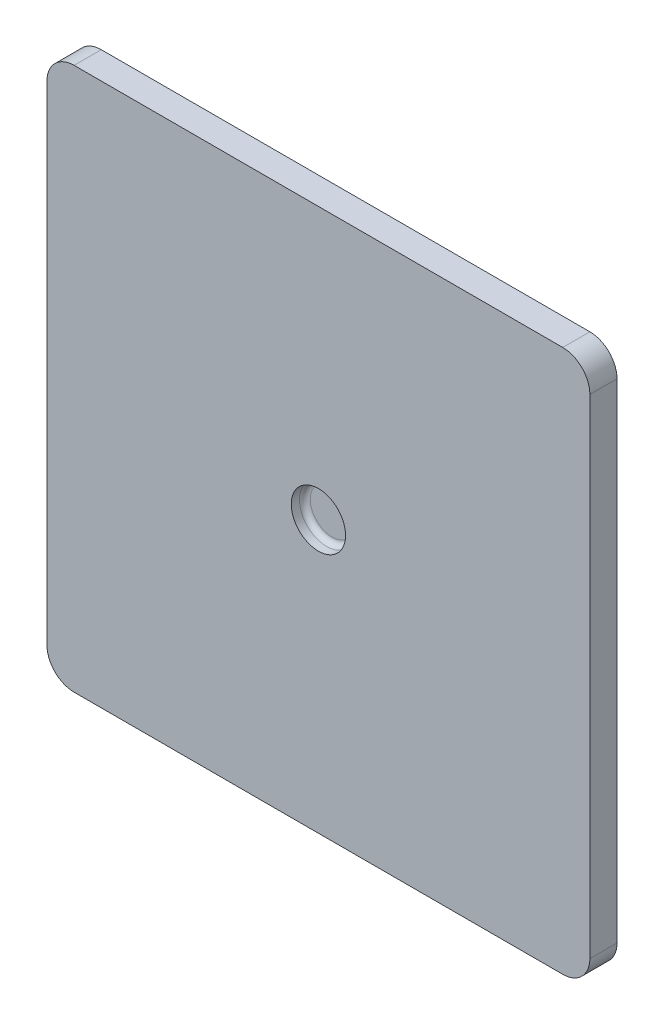
ISO-10303-21;
HEADER;
FILE_DESCRIPTION(('STEP AP214'),'2;1');
FILE_NAME('part.step','',(''),(''),'','','');
FILE_SCHEMA(('AUTOMOTIVE_DESIGN { 1 0 10303 214 1 1 1 1 }'));
ENDSEC;
DATA;
#1=APPLICATION_CONTEXT('core data for automotive mechanical design processes');
#2=APPLICATION_PROTOCOL_DEFINITION('international standard','automotive_design',2000,#1);
#3=PRODUCT_CONTEXT('',#1,'mechanical');
#4=PRODUCT('Part','Part','',(#3));
#5=PRODUCT_RELATED_PRODUCT_CATEGORY('part','',(#4));
#6=PRODUCT_DEFINITION_FORMATION('','',#4);
#7=PRODUCT_DEFINITION_CONTEXT('part definition',#1,'design');
#8=PRODUCT_DEFINITION('design','',#6,#7);
#9=PRODUCT_DEFINITION_SHAPE('','',#8);
#10=(LENGTH_UNIT() NAMED_UNIT(*) SI_UNIT(.MILLI.,.METRE.));
#11=(NAMED_UNIT(*) PLANE_ANGLE_UNIT() SI_UNIT($,.RADIAN.));
#12=(NAMED_UNIT(*) SI_UNIT($,.STERADIAN.) SOLID_ANGLE_UNIT());
#13=UNCERTAINTY_MEASURE_WITH_UNIT(LENGTH_MEASURE(1.E-05),#10,'distance_accuracy_value','');
#14=(GEOMETRIC_REPRESENTATION_CONTEXT(3) GLOBAL_UNCERTAINTY_ASSIGNED_CONTEXT((#13)) GLOBAL_UNIT_ASSIGNED_CONTEXT((#10,
#11,#12)) REPRESENTATION_CONTEXT('',''));
#15=CARTESIAN_POINT('',(0.,0.,0.));
#16=DIRECTION('',(0.,0.,1.));
#17=DIRECTION('',(1.,0.,0.));
#18=AXIS2_PLACEMENT_3D('',#15,#16,#17);
#19=CARTESIAN_POINT('',(-90.,90.,10.));
#20=DIRECTION('',(0.,0.,-1.));
#21=DIRECTION('',(-1.,0.,0.));
#22=AXIS2_PLACEMENT_3D('',#19,#20,#21);
#23=CYLINDRICAL_SURFACE('',#22,9.99999999999999);
#24=CARTESIAN_POINT('',(-90.,90.,0.));
#25=DIRECTION('',(0.,0.,1.));
#26=DIRECTION('',(-1.,0.,0.));
#27=AXIS2_PLACEMENT_3D('',#24,#25,#26);
#28=CIRCLE('',#27,9.99999999999999);
#29=CARTESIAN_POINT('',(-89.9999999999999,100.,0.));
#30=VERTEX_POINT('',#29);
#31=CARTESIAN_POINT('',(-100.,89.9999999999999,0.));
#32=VERTEX_POINT('',#31);
#33=EDGE_CURVE('E142',#30,#32,#28,.T.);
#34=ORIENTED_EDGE('',*,*,#33,.T.);
#35=DIRECTION('',(0.,0.,-1.));
#36=VECTOR('',#35,1.);
#37=CARTESIAN_POINT('',(-100.,89.9999999999999,10.));
#38=LINE('',#37,#36);
#39=CARTESIAN_POINT('',(-100.,89.9999999999999,10.));
#40=VERTEX_POINT('',#39);
#41=EDGE_CURVE('E184',#40,#32,#38,.T.);
#42=ORIENTED_EDGE('',*,*,#41,.F.);
#43=CARTESIAN_POINT('',(-90.,90.,10.));
#44=DIRECTION('',(0.,0.,1.));
#45=DIRECTION('',(-1.,0.,0.));
#46=AXIS2_PLACEMENT_3D('',#43,#44,#45);
#47=CIRCLE('',#46,9.99999999999999);
#48=CARTESIAN_POINT('',(-89.9999999999999,100.,10.));
#49=VERTEX_POINT('',#48);
#50=EDGE_CURVE('E165',#49,#40,#47,.T.);
#51=ORIENTED_EDGE('',*,*,#50,.F.);
#52=DIRECTION('',(0.,0.,-1.));
#53=VECTOR('',#52,1.);
#54=CARTESIAN_POINT('',(-89.9999999999999,100.,10.));
#55=LINE('',#54,#53);
#56=EDGE_CURVE('E138',#49,#30,#55,.T.);
#57=ORIENTED_EDGE('',*,*,#56,.T.);
#58=EDGE_LOOP('',(#34,#42,#51,#57));
#59=FACE_BOUND('',#58,.T.);
#60=ADVANCED_FACE('F39',(#59),#23,.T.);
#61=CARTESIAN_POINT('',(-100.,-89.9999999999999,10.));
#62=DIRECTION('',(1.,0.,0.));
#63=DIRECTION('',(0.,0.,-1.));
#64=AXIS2_PLACEMENT_3D('',#61,#62,#63);
#65=PLANE('',#64);
#66=DIRECTION('',(0.,-1.,0.));
#67=VECTOR('',#66,1.);
#68=CARTESIAN_POINT('',(-100.,-89.9999999999999,0.));
#69=LINE('',#68,#67);
#70=CARTESIAN_POINT('',(-100.,-89.9999999999999,0.));
#71=VERTEX_POINT('',#70);
#72=EDGE_CURVE('E146',#32,#71,#69,.T.);
#73=ORIENTED_EDGE('',*,*,#72,.T.);
#74=DIRECTION('',(0.,0.,-1.));
#75=VECTOR('',#74,1.);
#76=CARTESIAN_POINT('',(-100.,-89.9999999999999,10.));
#77=LINE('',#76,#75);
#78=CARTESIAN_POINT('',(-100.,-89.9999999999999,10.));
#79=VERTEX_POINT('',#78);
#80=EDGE_CURVE('E180',#79,#71,#77,.T.);
#81=ORIENTED_EDGE('',*,*,#80,.F.);
#82=DIRECTION('',(0.,-1.,0.));
#83=VECTOR('',#82,1.);
#84=CARTESIAN_POINT('',(-100.,-89.9999999999999,10.));
#85=LINE('',#84,#83);
#86=EDGE_CURVE('E101',#40,#79,#85,.T.);
#87=ORIENTED_EDGE('',*,*,#86,.F.);
#88=ORIENTED_EDGE('',*,*,#41,.T.);
#89=EDGE_LOOP('',(#73,#81,#87,#88));
#90=FACE_BOUND('',#89,.T.);
#91=ADVANCED_FACE('F201',(#90),#65,.F.);
#92=CARTESIAN_POINT('',(-90.,-90.,10.));
#93=DIRECTION('',(0.,0.,-1.));
#94=DIRECTION('',(-1.,0.,0.));
#95=AXIS2_PLACEMENT_3D('',#92,#93,#94);
#96=CYLINDRICAL_SURFACE('',#95,9.99999999999999);
#97=CARTESIAN_POINT('',(-90.,-90.,0.));
#98=DIRECTION('',(0.,0.,1.));
#99=DIRECTION('',(-1.,0.,0.));
#100=AXIS2_PLACEMENT_3D('',#97,#98,#99);
#101=CIRCLE('',#100,9.99999999999999);
#102=CARTESIAN_POINT('',(-89.9999999999999,-100.,0.));
#103=VERTEX_POINT('',#102);
#104=EDGE_CURVE('E150',#71,#103,#101,.T.);
#105=ORIENTED_EDGE('',*,*,#104,.T.);
#106=DIRECTION('',(0.,0.,-1.));
#107=VECTOR('',#106,1.);
#108=CARTESIAN_POINT('',(-89.9999999999999,-100.,10.));
#109=LINE('',#108,#107);
#110=CARTESIAN_POINT('',(-89.9999999999999,-100.,10.));
#111=VERTEX_POINT('',#110);
#112=EDGE_CURVE('E176',#111,#103,#109,.T.);
#113=ORIENTED_EDGE('',*,*,#112,.F.);
#114=CARTESIAN_POINT('',(-90.,-90.,10.));
#115=DIRECTION('',(0.,0.,1.));
#116=DIRECTION('',(-1.,0.,0.));
#117=AXIS2_PLACEMENT_3D('',#114,#115,#116);
#118=CIRCLE('',#117,9.99999999999999);
#119=EDGE_CURVE('E248',#79,#111,#118,.T.);
#120=ORIENTED_EDGE('',*,*,#119,.F.);
#121=ORIENTED_EDGE('',*,*,#80,.T.);
#122=EDGE_LOOP('',(#105,#113,#120,#121));
#123=FACE_BOUND('',#122,.T.);
#124=ADVANCED_FACE('F206',(#123),#96,.T.);
#125=CARTESIAN_POINT('',(-89.9999999999999,-100.,10.));
#126=DIRECTION('',(0.,1.,0.));
#127=DIRECTION('',(0.,0.,1.));
#128=AXIS2_PLACEMENT_3D('',#125,#126,#127);
#129=PLANE('',#128);
#130=DIRECTION('',(1.,0.,0.));
#131=VECTOR('',#130,1.);
#132=CARTESIAN_POINT('',(-89.9999999999999,-100.,0.));
#133=LINE('',#132,#131);
#134=CARTESIAN_POINT('',(89.9999999999999,-100.,0.));
#135=VERTEX_POINT('',#134);
#136=EDGE_CURVE('E153',#103,#135,#133,.T.);
#137=ORIENTED_EDGE('',*,*,#136,.T.);
#138=DIRECTION('',(0.,0.,-1.));
#139=VECTOR('',#138,1.);
#140=CARTESIAN_POINT('',(89.9999999999999,-100.,10.));
#141=LINE('',#140,#139);
#142=CARTESIAN_POINT('',(89.9999999999999,-100.,10.));
#143=VERTEX_POINT('',#142);
#144=EDGE_CURVE('E172',#143,#135,#141,.T.);
#145=ORIENTED_EDGE('',*,*,#144,.F.);
#146=DIRECTION('',(1.,0.,0.));
#147=VECTOR('',#146,1.);
#148=CARTESIAN_POINT('',(-89.9999999999999,-100.,10.));
#149=LINE('',#148,#147);
#150=EDGE_CURVE('E251',#111,#143,#149,.T.);
#151=ORIENTED_EDGE('',*,*,#150,.F.);
#152=ORIENTED_EDGE('',*,*,#112,.T.);
#153=EDGE_LOOP('',(#137,#145,#151,#152));
#154=FACE_BOUND('',#153,.T.);
#155=ADVANCED_FACE('F211',(#154),#129,.F.);
#156=CARTESIAN_POINT('',(90.,-90.,10.));
#157=DIRECTION('',(0.,0.,-1.));
#158=DIRECTION('',(-1.,0.,0.));
#159=AXIS2_PLACEMENT_3D('',#156,#157,#158);
#160=CYLINDRICAL_SURFACE('',#159,9.99999999999999);
#161=CARTESIAN_POINT('',(90.,-90.,0.));
#162=DIRECTION('',(0.,0.,1.));
#163=DIRECTION('',(1.,0.,0.));
#164=AXIS2_PLACEMENT_3D('',#161,#162,#163);
#165=CIRCLE('',#164,9.99999999999999);
#166=CARTESIAN_POINT('',(100.,-90.,0.));
#167=VERTEX_POINT('',#166);
#168=EDGE_CURVE('E156',#135,#167,#165,.T.);
#169=ORIENTED_EDGE('',*,*,#168,.T.);
#170=DIRECTION('',(0.,0.,-1.));
#171=VECTOR('',#170,1.);
#172=CARTESIAN_POINT('',(100.,-90.,10.));
#173=LINE('',#172,#171);
#174=CARTESIAN_POINT('',(100.,-90.,10.));
#175=VERTEX_POINT('',#174);
#176=EDGE_CURVE('E131',#175,#167,#173,.T.);
#177=ORIENTED_EDGE('',*,*,#176,.F.);
#178=CARTESIAN_POINT('',(90.,-90.,10.));
#179=DIRECTION('',(0.,0.,1.));
#180=DIRECTION('',(1.,0.,0.));
#181=AXIS2_PLACEMENT_3D('',#178,#179,#180);
#182=CIRCLE('',#181,9.99999999999999);
#183=EDGE_CURVE('E120',#143,#175,#182,.T.);
#184=ORIENTED_EDGE('',*,*,#183,.F.);
#185=ORIENTED_EDGE('',*,*,#144,.T.);
#186=EDGE_LOOP('',(#169,#177,#184,#185));
#187=FACE_BOUND('',#186,.T.);
#188=ADVANCED_FACE('F215',(#187),#160,.T.);
#189=CARTESIAN_POINT('',(100.,-89.9999999999999,10.));
#190=DIRECTION('',(-1.,0.,0.));
#191=DIRECTION('',(0.,0.,1.));
#192=AXIS2_PLACEMENT_3D('',#189,#190,#191);
#193=PLANE('',#192);
#194=DIRECTION('',(0.,1.,0.));
#195=VECTOR('',#194,1.);
#196=CARTESIAN_POINT('',(100.,-89.9999999999999,0.));
#197=LINE('',#196,#195);
#198=CARTESIAN_POINT('',(100.,89.9999999999999,0.));
#199=VERTEX_POINT('',#198);
#200=EDGE_CURVE('E129',#167,#199,#197,.T.);
#201=ORIENTED_EDGE('',*,*,#200,.T.);
#202=DIRECTION('',(0.,0.,-1.));
#203=VECTOR('',#202,1.);
#204=CARTESIAN_POINT('',(100.,89.9999999999999,10.));
#205=LINE('',#204,#203);
#206=CARTESIAN_POINT('',(100.,89.9999999999999,10.));
#207=VERTEX_POINT('',#206);
#208=EDGE_CURVE('E126',#207,#199,#205,.T.);
#209=ORIENTED_EDGE('',*,*,#208,.F.);
#210=DIRECTION('',(0.,1.,0.));
#211=VECTOR('',#210,1.);
#212=CARTESIAN_POINT('',(100.,-89.9999999999999,10.));
#213=LINE('',#212,#211);
#214=EDGE_CURVE('E114',#175,#207,#213,.T.);
#215=ORIENTED_EDGE('',*,*,#214,.F.);
#216=ORIENTED_EDGE('',*,*,#176,.T.);
#217=EDGE_LOOP('',(#201,#209,#215,#216));
#218=FACE_BOUND('',#217,.T.);
#219=ADVANCED_FACE('F127',(#218),#193,.F.);
#220=CARTESIAN_POINT('',(90.,90.,10.));
#221=DIRECTION('',(0.,0.,-1.));
#222=DIRECTION('',(-1.,0.,0.));
#223=AXIS2_PLACEMENT_3D('',#220,#221,#222);
#224=CYLINDRICAL_SURFACE('',#223,9.99999999999999);
#225=CARTESIAN_POINT('',(90.,90.,0.));
#226=DIRECTION('',(0.,0.,1.));
#227=DIRECTION('',(1.,0.,0.));
#228=AXIS2_PLACEMENT_3D('',#225,#226,#227);
#229=CIRCLE('',#228,9.99999999999999);
#230=CARTESIAN_POINT('',(89.9999999999999,100.,0.));
#231=VERTEX_POINT('',#230);
#232=EDGE_CURVE('E86',#199,#231,#229,.T.);
#233=ORIENTED_EDGE('',*,*,#232,.T.);
#234=DIRECTION('',(0.,0.,-1.));
#235=VECTOR('',#234,1.);
#236=CARTESIAN_POINT('',(89.9999999999999,100.,10.));
#237=LINE('',#236,#235);
#238=CARTESIAN_POINT('',(89.9999999999999,100.,10.));
#239=VERTEX_POINT('',#238);
#240=EDGE_CURVE('E132',#239,#231,#237,.T.);
#241=ORIENTED_EDGE('',*,*,#240,.F.);
#242=CARTESIAN_POINT('',(90.,90.,10.));
#243=DIRECTION('',(0.,0.,1.));
#244=DIRECTION('',(1.,0.,0.));
#245=AXIS2_PLACEMENT_3D('',#242,#243,#244);
#246=CIRCLE('',#245,9.99999999999999);
#247=EDGE_CURVE('E118',#207,#239,#246,.T.);
#248=ORIENTED_EDGE('',*,*,#247,.F.);
#249=ORIENTED_EDGE('',*,*,#208,.T.);
#250=EDGE_LOOP('',(#233,#241,#248,#249));
#251=FACE_BOUND('',#250,.T.);
#252=ADVANCED_FACE('F134',(#251),#224,.T.);
#253=CARTESIAN_POINT('',(-89.9999999999999,100.,10.));
#254=DIRECTION('',(0.,-1.,0.));
#255=DIRECTION('',(0.,0.,-1.));
#256=AXIS2_PLACEMENT_3D('',#253,#254,#255);
#257=PLANE('',#256);
#258=DIRECTION('',(-1.,0.,0.));
#259=VECTOR('',#258,1.);
#260=CARTESIAN_POINT('',(-89.9999999999999,100.,0.));
#261=LINE('',#260,#259);
#262=EDGE_CURVE('E92',#231,#30,#261,.T.);
#263=ORIENTED_EDGE('',*,*,#262,.T.);
#264=ORIENTED_EDGE('',*,*,#56,.F.);
#265=DIRECTION('',(-1.,0.,0.));
#266=VECTOR('',#265,1.);
#267=CARTESIAN_POINT('',(-89.9999999999999,100.,10.));
#268=LINE('',#267,#266);
#269=EDGE_CURVE('E57',#239,#49,#268,.T.);
#270=ORIENTED_EDGE('',*,*,#269,.F.);
#271=ORIENTED_EDGE('',*,*,#240,.T.);
#272=EDGE_LOOP('',(#263,#264,#270,#271));
#273=FACE_BOUND('',#272,.T.);
#274=ADVANCED_FACE('F224',(#273),#257,.F.);
#275=CARTESIAN_POINT('',(-90.,90.,10.));
#276=DIRECTION('',(0.,0.,-1.));
#277=DIRECTION('',(-1.,0.,0.));
#278=AXIS2_PLACEMENT_3D('',#275,#276,#277);
#279=PLANE('',#278);
#280=CARTESIAN_POINT('',(0.,0.,10.));
#281=DIRECTION('',(0.,0.,1.));
#282=DIRECTION('',(1.,0.,0.));
#283=AXIS2_PLACEMENT_3D('',#280,#281,#282);
#284=CIRCLE('',#283,10.);
#285=CARTESIAN_POINT('',(10.,0.,10.));
#286=VERTEX_POINT('',#285);
#287=EDGE_CURVE('E147',#286,#286,#284,.T.);
#288=ORIENTED_EDGE('',*,*,#287,.F.);
#289=EDGE_LOOP('',(#288));
#290=FACE_BOUND('',#289,.T.);
#291=ORIENTED_EDGE('',*,*,#50,.T.);
#292=ORIENTED_EDGE('',*,*,#86,.T.);
#293=ORIENTED_EDGE('',*,*,#119,.T.);
#294=ORIENTED_EDGE('',*,*,#150,.T.);
#295=ORIENTED_EDGE('',*,*,#183,.T.);
#296=ORIENTED_EDGE('',*,*,#214,.T.);
#297=ORIENTED_EDGE('',*,*,#247,.T.);
#298=ORIENTED_EDGE('',*,*,#269,.T.);
#299=EDGE_LOOP('',(#291,#292,#293,#294,#295,#296,#297,#298));
#300=FACE_BOUND('',#299,.T.);
#301=ADVANCED_FACE('F116',(#290,#300),#279,.F.);
#302=CARTESIAN_POINT('',(-90.,90.,0.));
#303=DIRECTION('',(0.,0.,-1.));
#304=DIRECTION('',(-1.,0.,0.));
#305=AXIS2_PLACEMENT_3D('',#302,#303,#304);
#306=PLANE('',#305);
#307=ORIENTED_EDGE('',*,*,#33,.F.);
#308=ORIENTED_EDGE('',*,*,#262,.F.);
#309=ORIENTED_EDGE('',*,*,#232,.F.);
#310=ORIENTED_EDGE('',*,*,#200,.F.);
#311=ORIENTED_EDGE('',*,*,#168,.F.);
#312=ORIENTED_EDGE('',*,*,#136,.F.);
#313=ORIENTED_EDGE('',*,*,#104,.F.);
#314=ORIENTED_EDGE('',*,*,#72,.F.);
#315=EDGE_LOOP('',(#307,#308,#309,#310,#311,#312,#313,#314));
#316=FACE_BOUND('',#315,.T.);
#317=ADVANCED_FACE('F227',(#316),#306,.T.);
#318=CARTESIAN_POINT('',(0.,0.,5.));
#319=DIRECTION('',(0.,0.,1.));
#320=DIRECTION('',(1.,0.,0.));
#321=AXIS2_PLACEMENT_3D('',#318,#319,#320);
#322=CYLINDRICAL_SURFACE('',#321,10.);
#323=CARTESIAN_POINT('',(0.,0.,7.));
#324=DIRECTION('',(0.,0.,1.));
#325=DIRECTION('',(1.,0.,0.));
#326=AXIS2_PLACEMENT_3D('',#323,#324,#325);
#327=CIRCLE('',#326,10.);
#328=CARTESIAN_POINT('',(10.,0.,7.));
#329=VERTEX_POINT('',#328);
#330=EDGE_CURVE('E11',#329,#329,#327,.F.);
#331=ORIENTED_EDGE('',*,*,#330,.T.);
#332=EDGE_LOOP('',(#331));
#333=FACE_BOUND('',#332,.T.);
#334=ORIENTED_EDGE('',*,*,#287,.T.);
#335=EDGE_LOOP('',(#334));
#336=FACE_BOUND('',#335,.T.);
#337=ADVANCED_FACE('F197',(#333,#336),#322,.F.);
#338=CARTESIAN_POINT('',(0.,0.,5.));
#339=DIRECTION('',(0.,0.,1.));
#340=DIRECTION('',(1.,0.,0.));
#341=AXIS2_PLACEMENT_3D('',#338,#339,#340);
#342=PLANE('',#341);
#343=CARTESIAN_POINT('',(0.,0.,5.));
#344=DIRECTION('',(0.,0.,1.));
#345=DIRECTION('',(1.,0.,0.));
#346=AXIS2_PLACEMENT_3D('',#343,#344,#345);
#347=CIRCLE('',#346,8.);
#348=CARTESIAN_POINT('',(8.,0.,5.));
#349=VERTEX_POINT('',#348);
#350=EDGE_CURVE('E49',#349,#349,#347,.T.);
#351=ORIENTED_EDGE('',*,*,#350,.T.);
#352=EDGE_LOOP('',(#351));
#353=FACE_BOUND('',#352,.T.);
#354=ADVANCED_FACE('F190',(#353),#342,.T.);
#355=CARTESIAN_POINT('',(0.,0.,7.));
#356=DIRECTION('',(0.,0.,1.));
#357=DIRECTION('',(1.,0.,0.));
#358=AXIS2_PLACEMENT_3D('',#355,#356,#357);
#359=TOROIDAL_SURFACE('',#358,8.,2.);
#360=ORIENTED_EDGE('',*,*,#330,.F.);
#361=EDGE_LOOP('',(#360));
#362=FACE_BOUND('',#361,.T.);
#363=ORIENTED_EDGE('',*,*,#350,.F.);
#364=EDGE_LOOP('',(#363));
#365=FACE_BOUND('',#364,.T.);
#366=ADVANCED_FACE('F41',(#362,#365),#359,.F.);
#367=CLOSED_SHELL('',(#60,#91,#124,#155,#188,#219,#252,#274,#301,#317,#337,#354,#366));
#368=MANIFOLD_SOLID_BREP('B2',#367);
#369=ADVANCED_BREP_SHAPE_REPRESENTATION('',(#18,#368),#14);
#370=SHAPE_DEFINITION_REPRESENTATION(#9,#369);
ENDSEC;
END-ISO-10303-21;
